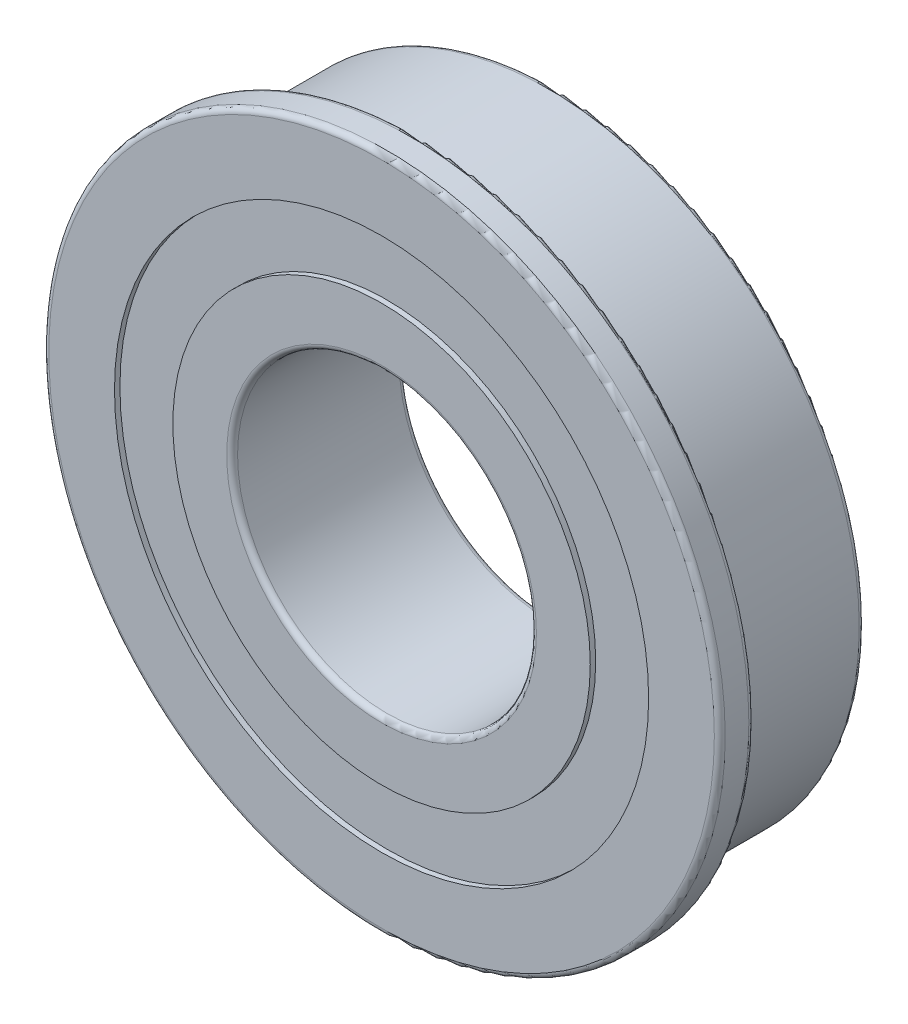
ISO-10303-21;
HEADER;
FILE_DESCRIPTION(('STEP AP214'),'2;1');
FILE_NAME('part.step','',(''),(''),'','','');
FILE_SCHEMA(('AUTOMOTIVE_DESIGN { 1 0 10303 214 1 1 1 1 }'));
ENDSEC;
DATA;
#1=APPLICATION_CONTEXT('core data for automotive mechanical design processes');
#2=APPLICATION_PROTOCOL_DEFINITION('international standard','automotive_design',2000,#1);
#3=PRODUCT_CONTEXT('',#1,'mechanical');
#4=PRODUCT('Part','Part','',(#3));
#5=PRODUCT_RELATED_PRODUCT_CATEGORY('part','',(#4));
#6=PRODUCT_DEFINITION_FORMATION('','',#4);
#7=PRODUCT_DEFINITION_CONTEXT('part definition',#1,'design');
#8=PRODUCT_DEFINITION('design','',#6,#7);
#9=PRODUCT_DEFINITION_SHAPE('','',#8);
#10=(LENGTH_UNIT() NAMED_UNIT(*) SI_UNIT(.MILLI.,.METRE.));
#11=(NAMED_UNIT(*) PLANE_ANGLE_UNIT() SI_UNIT($,.RADIAN.));
#12=(NAMED_UNIT(*) SI_UNIT($,.STERADIAN.) SOLID_ANGLE_UNIT());
#13=UNCERTAINTY_MEASURE_WITH_UNIT(LENGTH_MEASURE(1.E-05),#10,'distance_accuracy_value','');
#14=(GEOMETRIC_REPRESENTATION_CONTEXT(3) GLOBAL_UNCERTAINTY_ASSIGNED_CONTEXT((#13)) GLOBAL_UNIT_ASSIGNED_CONTEXT((#10,
#11,#12)) REPRESENTATION_CONTEXT('',''));
#15=CARTESIAN_POINT('',(0.,0.,0.));
#16=DIRECTION('',(0.,0.,1.));
#17=DIRECTION('',(1.,0.,0.));
#18=AXIS2_PLACEMENT_3D('',#15,#16,#17);
#19=CARTESIAN_POINT('',(0.,0.,-3.71875));
#20=DIRECTION('',(0.,0.,1.));
#21=DIRECTION('',(1.,0.,0.));
#22=AXIS2_PLACEMENT_3D('',#19,#20,#21);
#23=TOROIDAL_SURFACE('',#22,14.0375,0.25);
#24=CARTESIAN_POINT('',(0.,0.,-3.96875));
#25=DIRECTION('',(0.,0.,1.));
#26=DIRECTION('',(1.,0.,0.));
#27=AXIS2_PLACEMENT_3D('',#24,#25,#26);
#28=CIRCLE('',#27,14.0375);
#29=CARTESIAN_POINT('',(14.0375,0.,-3.96875));
#30=VERTEX_POINT('',#29);
#31=EDGE_CURVE('E10',#30,#30,#28,.T.);
#32=ORIENTED_EDGE('',*,*,#31,.T.);
#33=EDGE_LOOP('',(#32));
#34=FACE_BOUND('',#33,.T.);
#35=CARTESIAN_POINT('',(0.,0.,-3.71875));
#36=DIRECTION('',(0.,0.,1.));
#37=DIRECTION('',(1.,0.,0.));
#38=AXIS2_PLACEMENT_3D('',#35,#36,#37);
#39=CIRCLE('',#38,14.2875);
#40=CARTESIAN_POINT('',(14.2875,0.,-3.71875));
#41=VERTEX_POINT('',#40);
#42=EDGE_CURVE('E97',#41,#41,#39,.T.);
#43=ORIENTED_EDGE('',*,*,#42,.F.);
#44=EDGE_LOOP('',(#43));
#45=FACE_BOUND('',#44,.T.);
#46=ADVANCED_FACE('F30',(#34,#45),#23,.T.);
#47=CARTESIAN_POINT('',(14.0375,0.,-3.96875));
#48=DIRECTION('',(0.,0.,-1.));
#49=DIRECTION('',(-1.,0.,0.));
#50=AXIS2_PLACEMENT_3D('',#47,#48,#49);
#51=PLANE('',#50);
#52=CARTESIAN_POINT('',(0.,0.,-3.96875));
#53=DIRECTION('',(0.,0.,1.));
#54=DIRECTION('',(1.,0.,0.));
#55=AXIS2_PLACEMENT_3D('',#52,#53,#54);
#56=CIRCLE('',#55,12.2875);
#57=CARTESIAN_POINT('',(12.2875,0.,-3.96875));
#58=VERTEX_POINT('',#57);
#59=EDGE_CURVE('E36',#58,#58,#56,.T.);
#60=ORIENTED_EDGE('',*,*,#59,.T.);
#61=EDGE_LOOP('',(#60));
#62=FACE_BOUND('',#61,.T.);
#63=ORIENTED_EDGE('',*,*,#31,.F.);
#64=EDGE_LOOP('',(#63));
#65=FACE_BOUND('',#64,.T.);
#66=ADVANCED_FACE('F105',(#62,#65),#51,.T.);
#67=CARTESIAN_POINT('',(0.,0.,-3.9700039936204));
#68=DIRECTION('',(0.,0.,1.));
#69=DIRECTION('',(1.,0.,0.));
#70=AXIS2_PLACEMENT_3D('',#67,#68,#69);
#71=CYLINDRICAL_SURFACE('',#70,12.2875);
#72=CARTESIAN_POINT('',(0.,0.,-3.71875));
#73=DIRECTION('',(0.,0.,1.));
#74=DIRECTION('',(1.,0.,0.));
#75=AXIS2_PLACEMENT_3D('',#72,#73,#74);
#76=CIRCLE('',#75,12.2875);
#77=CARTESIAN_POINT('',(12.2875,0.,-3.71875));
#78=VERTEX_POINT('',#77);
#79=EDGE_CURVE('E40',#78,#78,#76,.T.);
#80=ORIENTED_EDGE('',*,*,#79,.T.);
#81=EDGE_LOOP('',(#80));
#82=FACE_BOUND('',#81,.T.);
#83=ORIENTED_EDGE('',*,*,#59,.F.);
#84=EDGE_LOOP('',(#83));
#85=FACE_BOUND('',#84,.T.);
#86=ADVANCED_FACE('F109',(#82,#85),#71,.F.);
#87=CARTESIAN_POINT('',(12.2875,0.,-3.71875));
#88=DIRECTION('',(0.,0.,-1.));
#89=DIRECTION('',(-1.,0.,0.));
#90=AXIS2_PLACEMENT_3D('',#87,#88,#89);
#91=PLANE('',#90);
#92=CARTESIAN_POINT('',(0.,0.,-3.71875));
#93=DIRECTION('',(0.,0.,1.));
#94=DIRECTION('',(1.,0.,0.));
#95=AXIS2_PLACEMENT_3D('',#92,#93,#94);
#96=CIRCLE('',#95,9.602);
#97=CARTESIAN_POINT('',(9.602,0.,-3.71875));
#98=VERTEX_POINT('',#97);
#99=EDGE_CURVE('E44',#98,#98,#96,.T.);
#100=ORIENTED_EDGE('',*,*,#99,.T.);
#101=EDGE_LOOP('',(#100));
#102=FACE_BOUND('',#101,.T.);
#103=ORIENTED_EDGE('',*,*,#79,.F.);
#104=EDGE_LOOP('',(#103));
#105=FACE_BOUND('',#104,.T.);
#106=ADVANCED_FACE('F113',(#102,#105),#91,.T.);
#107=CARTESIAN_POINT('',(0.,0.,-3.9700039936204));
#108=DIRECTION('',(0.,0.,1.));
#109=DIRECTION('',(1.,0.,0.));
#110=AXIS2_PLACEMENT_3D('',#107,#108,#109);
#111=CYLINDRICAL_SURFACE('',#110,9.602);
#112=CARTESIAN_POINT('',(0.,0.,-3.96875));
#113=DIRECTION('',(0.,0.,1.));
#114=DIRECTION('',(1.,0.,0.));
#115=AXIS2_PLACEMENT_3D('',#112,#113,#114);
#116=CIRCLE('',#115,9.602);
#117=CARTESIAN_POINT('',(9.602,0.,-3.96875));
#118=VERTEX_POINT('',#117);
#119=EDGE_CURVE('E49',#118,#118,#116,.T.);
#120=ORIENTED_EDGE('',*,*,#119,.T.);
#121=EDGE_LOOP('',(#120));
#122=FACE_BOUND('',#121,.T.);
#123=ORIENTED_EDGE('',*,*,#99,.F.);
#124=EDGE_LOOP('',(#123));
#125=FACE_BOUND('',#124,.T.);
#126=ADVANCED_FACE('F120',(#122,#125),#111,.T.);
#127=CARTESIAN_POINT('',(9.602,0.,-3.96875));
#128=DIRECTION('',(0.,0.,-1.));
#129=DIRECTION('',(-1.,0.,0.));
#130=AXIS2_PLACEMENT_3D('',#127,#128,#129);
#131=PLANE('',#130);
#132=CARTESIAN_POINT('',(0.,0.,-3.96875));
#133=DIRECTION('',(0.,0.,1.));
#134=DIRECTION('',(1.,0.,0.));
#135=AXIS2_PLACEMENT_3D('',#132,#133,#134);
#136=CIRCLE('',#135,7.125);
#137=CARTESIAN_POINT('',(7.125,0.,-3.96875));
#138=VERTEX_POINT('',#137);
#139=EDGE_CURVE('E52',#138,#138,#136,.T.);
#140=ORIENTED_EDGE('',*,*,#139,.T.);
#141=EDGE_LOOP('',(#140));
#142=FACE_BOUND('',#141,.T.);
#143=ORIENTED_EDGE('',*,*,#119,.F.);
#144=EDGE_LOOP('',(#143));
#145=FACE_BOUND('',#144,.T.);
#146=ADVANCED_FACE('F124',(#142,#145),#131,.T.);
#147=CARTESIAN_POINT('',(0.,0.,-3.71875));
#148=DIRECTION('',(0.,0.,1.));
#149=DIRECTION('',(1.,0.,0.));
#150=AXIS2_PLACEMENT_3D('',#147,#148,#149);
#151=TOROIDAL_SURFACE('',#150,7.125,0.25);
#152=CARTESIAN_POINT('',(0.,0.,-3.71875));
#153=DIRECTION('',(0.,0.,1.));
#154=DIRECTION('',(1.,0.,0.));
#155=AXIS2_PLACEMENT_3D('',#152,#153,#154);
#156=CIRCLE('',#155,6.875);
#157=CARTESIAN_POINT('',(6.875,0.,-3.71875));
#158=VERTEX_POINT('',#157);
#159=EDGE_CURVE('E55',#158,#158,#156,.T.);
#160=ORIENTED_EDGE('',*,*,#159,.T.);
#161=EDGE_LOOP('',(#160));
#162=FACE_BOUND('',#161,.T.);
#163=ORIENTED_EDGE('',*,*,#139,.F.);
#164=EDGE_LOOP('',(#163));
#165=FACE_BOUND('',#164,.T.);
#166=ADVANCED_FACE('F128',(#162,#165),#151,.T.);
#167=CARTESIAN_POINT('',(0.,0.,-3.9700039936204));
#168=DIRECTION('',(0.,0.,1.));
#169=DIRECTION('',(1.,0.,0.));
#170=AXIS2_PLACEMENT_3D('',#167,#168,#169);
#171=CYLINDRICAL_SURFACE('',#170,6.875);
#172=CARTESIAN_POINT('',(0.,0.,3.71875));
#173=DIRECTION('',(0.,0.,1.));
#174=DIRECTION('',(1.,0.,0.));
#175=AXIS2_PLACEMENT_3D('',#172,#173,#174);
#176=CIRCLE('',#175,6.875);
#177=CARTESIAN_POINT('',(6.875,0.,3.71875));
#178=VERTEX_POINT('',#177);
#179=EDGE_CURVE('E58',#178,#178,#176,.T.);
#180=ORIENTED_EDGE('',*,*,#179,.T.);
#181=EDGE_LOOP('',(#180));
#182=FACE_BOUND('',#181,.T.);
#183=ORIENTED_EDGE('',*,*,#159,.F.);
#184=EDGE_LOOP('',(#183));
#185=FACE_BOUND('',#184,.T.);
#186=ADVANCED_FACE('F132',(#182,#185),#171,.F.);
#187=CARTESIAN_POINT('',(0.,0.,3.71875));
#188=DIRECTION('',(0.,0.,1.));
#189=DIRECTION('',(1.,0.,0.));
#190=AXIS2_PLACEMENT_3D('',#187,#188,#189);
#191=TOROIDAL_SURFACE('',#190,7.125,0.25);
#192=CARTESIAN_POINT('',(0.,0.,3.96875));
#193=DIRECTION('',(0.,0.,1.));
#194=DIRECTION('',(1.,0.,0.));
#195=AXIS2_PLACEMENT_3D('',#192,#193,#194);
#196=CIRCLE('',#195,7.125);
#197=CARTESIAN_POINT('',(7.125,0.,3.96875));
#198=VERTEX_POINT('',#197);
#199=EDGE_CURVE('E61',#198,#198,#196,.T.);
#200=ORIENTED_EDGE('',*,*,#199,.T.);
#201=EDGE_LOOP('',(#200));
#202=FACE_BOUND('',#201,.T.);
#203=ORIENTED_EDGE('',*,*,#179,.F.);
#204=EDGE_LOOP('',(#203));
#205=FACE_BOUND('',#204,.T.);
#206=ADVANCED_FACE('F136',(#202,#205),#191,.T.);
#207=CARTESIAN_POINT('',(7.125,0.,3.96875));
#208=DIRECTION('',(0.,0.,1.));
#209=DIRECTION('',(1.,0.,0.));
#210=AXIS2_PLACEMENT_3D('',#207,#208,#209);
#211=PLANE('',#210);
#212=CARTESIAN_POINT('',(0.,0.,3.96875));
#213=DIRECTION('',(0.,0.,1.));
#214=DIRECTION('',(1.,0.,0.));
#215=AXIS2_PLACEMENT_3D('',#212,#213,#214);
#216=CIRCLE('',#215,9.602);
#217=CARTESIAN_POINT('',(9.602,0.,3.96875));
#218=VERTEX_POINT('',#217);
#219=EDGE_CURVE('E64',#218,#218,#216,.T.);
#220=ORIENTED_EDGE('',*,*,#219,.T.);
#221=EDGE_LOOP('',(#220));
#222=FACE_BOUND('',#221,.T.);
#223=ORIENTED_EDGE('',*,*,#199,.F.);
#224=EDGE_LOOP('',(#223));
#225=FACE_BOUND('',#224,.T.);
#226=ADVANCED_FACE('F140',(#222,#225),#211,.T.);
#227=CARTESIAN_POINT('',(0.,0.,-3.9700039936204));
#228=DIRECTION('',(0.,0.,1.));
#229=DIRECTION('',(1.,0.,0.));
#230=AXIS2_PLACEMENT_3D('',#227,#228,#229);
#231=CYLINDRICAL_SURFACE('',#230,9.602);
#232=CARTESIAN_POINT('',(0.,0.,3.71875));
#233=DIRECTION('',(0.,0.,1.));
#234=DIRECTION('',(1.,0.,0.));
#235=AXIS2_PLACEMENT_3D('',#232,#233,#234);
#236=CIRCLE('',#235,9.602);
#237=CARTESIAN_POINT('',(9.602,0.,3.71875));
#238=VERTEX_POINT('',#237);
#239=EDGE_CURVE('E67',#238,#238,#236,.T.);
#240=ORIENTED_EDGE('',*,*,#239,.T.);
#241=EDGE_LOOP('',(#240));
#242=FACE_BOUND('',#241,.T.);
#243=ORIENTED_EDGE('',*,*,#219,.F.);
#244=EDGE_LOOP('',(#243));
#245=FACE_BOUND('',#244,.T.);
#246=ADVANCED_FACE('F144',(#242,#245),#231,.T.);
#247=CARTESIAN_POINT('',(9.602,0.,3.71875));
#248=DIRECTION('',(0.,0.,1.));
#249=DIRECTION('',(1.,0.,0.));
#250=AXIS2_PLACEMENT_3D('',#247,#248,#249);
#251=PLANE('',#250);
#252=CARTESIAN_POINT('',(0.,0.,3.71875));
#253=DIRECTION('',(0.,0.,1.));
#254=DIRECTION('',(1.,0.,0.));
#255=AXIS2_PLACEMENT_3D('',#252,#253,#254);
#256=CIRCLE('',#255,12.2875);
#257=CARTESIAN_POINT('',(12.2875,0.,3.71875));
#258=VERTEX_POINT('',#257);
#259=EDGE_CURVE('E70',#258,#258,#256,.T.);
#260=ORIENTED_EDGE('',*,*,#259,.T.);
#261=EDGE_LOOP('',(#260));
#262=FACE_BOUND('',#261,.T.);
#263=ORIENTED_EDGE('',*,*,#239,.F.);
#264=EDGE_LOOP('',(#263));
#265=FACE_BOUND('',#264,.T.);
#266=ADVANCED_FACE('F148',(#262,#265),#251,.T.);
#267=CARTESIAN_POINT('',(0.,0.,-3.9700039936204));
#268=DIRECTION('',(0.,0.,1.));
#269=DIRECTION('',(1.,0.,0.));
#270=AXIS2_PLACEMENT_3D('',#267,#268,#269);
#271=CYLINDRICAL_SURFACE('',#270,12.2875);
#272=CARTESIAN_POINT('',(0.,0.,3.96875));
#273=DIRECTION('',(0.,0.,1.));
#274=DIRECTION('',(1.,0.,0.));
#275=AXIS2_PLACEMENT_3D('',#272,#273,#274);
#276=CIRCLE('',#275,12.2875);
#277=CARTESIAN_POINT('',(12.2875,0.,3.96875));
#278=VERTEX_POINT('',#277);
#279=EDGE_CURVE('E73',#278,#278,#276,.T.);
#280=ORIENTED_EDGE('',*,*,#279,.T.);
#281=EDGE_LOOP('',(#280));
#282=FACE_BOUND('',#281,.T.);
#283=ORIENTED_EDGE('',*,*,#259,.F.);
#284=EDGE_LOOP('',(#283));
#285=FACE_BOUND('',#284,.T.);
#286=ADVANCED_FACE('F152',(#282,#285),#271,.F.);
#287=CARTESIAN_POINT('',(12.2875,0.,3.96875));
#288=DIRECTION('',(0.,0.,1.));
#289=DIRECTION('',(1.,0.,0.));
#290=AXIS2_PLACEMENT_3D('',#287,#288,#289);
#291=PLANE('',#290);
#292=CARTESIAN_POINT('',(0.,0.,3.96875));
#293=DIRECTION('',(0.,0.,1.));
#294=DIRECTION('',(1.,0.,0.));
#295=AXIS2_PLACEMENT_3D('',#292,#293,#294);
#296=CIRCLE('',#295,15.31);
#297=CARTESIAN_POINT('',(15.31,0.,3.96875));
#298=VERTEX_POINT('',#297);
#299=EDGE_CURVE('E76',#298,#298,#296,.T.);
#300=ORIENTED_EDGE('',*,*,#299,.T.);
#301=EDGE_LOOP('',(#300));
#302=FACE_BOUND('',#301,.T.);
#303=ORIENTED_EDGE('',*,*,#279,.F.);
#304=EDGE_LOOP('',(#303));
#305=FACE_BOUND('',#304,.T.);
#306=ADVANCED_FACE('F156',(#302,#305),#291,.T.);
#307=CARTESIAN_POINT('',(0.,0.,3.71875));
#308=DIRECTION('',(0.,0.,1.));
#309=DIRECTION('',(1.,0.,0.));
#310=AXIS2_PLACEMENT_3D('',#307,#308,#309);
#311=TOROIDAL_SURFACE('',#310,15.31,0.25);
#312=CARTESIAN_POINT('',(0.,0.,3.71875));
#313=DIRECTION('',(0.,0.,1.));
#314=DIRECTION('',(1.,0.,0.));
#315=AXIS2_PLACEMENT_3D('',#312,#313,#314);
#316=CIRCLE('',#315,15.56);
#317=CARTESIAN_POINT('',(15.56,0.,3.71875));
#318=VERTEX_POINT('',#317);
#319=EDGE_CURVE('E79',#318,#318,#316,.T.);
#320=ORIENTED_EDGE('',*,*,#319,.T.);
#321=EDGE_LOOP('',(#320));
#322=FACE_BOUND('',#321,.T.);
#323=ORIENTED_EDGE('',*,*,#299,.F.);
#324=EDGE_LOOP('',(#323));
#325=FACE_BOUND('',#324,.T.);
#326=ADVANCED_FACE('F160',(#322,#325),#311,.T.);
#327=CARTESIAN_POINT('',(0.,0.,-3.9700039936204));
#328=DIRECTION('',(0.,0.,1.));
#329=DIRECTION('',(1.,0.,0.));
#330=AXIS2_PLACEMENT_3D('',#327,#328,#329);
#331=CYLINDRICAL_SURFACE('',#330,15.56);
#332=CARTESIAN_POINT('',(0.,0.,2.63125));
#333=DIRECTION('',(0.,0.,1.));
#334=DIRECTION('',(1.,0.,0.));
#335=AXIS2_PLACEMENT_3D('',#332,#333,#334);
#336=CIRCLE('',#335,15.56);
#337=CARTESIAN_POINT('',(15.56,0.,2.63125));
#338=VERTEX_POINT('',#337);
#339=EDGE_CURVE('E82',#338,#338,#336,.T.);
#340=ORIENTED_EDGE('',*,*,#339,.T.);
#341=EDGE_LOOP('',(#340));
#342=FACE_BOUND('',#341,.T.);
#343=ORIENTED_EDGE('',*,*,#319,.F.);
#344=EDGE_LOOP('',(#343));
#345=FACE_BOUND('',#344,.T.);
#346=ADVANCED_FACE('F164',(#342,#345),#331,.T.);
#347=CARTESIAN_POINT('',(0.,0.,2.63125));
#348=DIRECTION('',(0.,0.,1.));
#349=DIRECTION('',(1.,0.,0.));
#350=AXIS2_PLACEMENT_3D('',#347,#348,#349);
#351=TOROIDAL_SURFACE('',#350,15.31,0.25);
#352=CARTESIAN_POINT('',(0.,0.,2.38125));
#353=DIRECTION('',(0.,0.,1.));
#354=DIRECTION('',(1.,0.,0.));
#355=AXIS2_PLACEMENT_3D('',#352,#353,#354);
#356=CIRCLE('',#355,15.31);
#357=CARTESIAN_POINT('',(15.31,0.,2.38125));
#358=VERTEX_POINT('',#357);
#359=EDGE_CURVE('E85',#358,#358,#356,.T.);
#360=ORIENTED_EDGE('',*,*,#359,.T.);
#361=EDGE_LOOP('',(#360));
#362=FACE_BOUND('',#361,.T.);
#363=ORIENTED_EDGE('',*,*,#339,.F.);
#364=EDGE_LOOP('',(#363));
#365=FACE_BOUND('',#364,.T.);
#366=ADVANCED_FACE('F168',(#362,#365),#351,.T.);
#367=CARTESIAN_POINT('',(15.31,0.,2.38125));
#368=DIRECTION('',(0.,0.,-1.));
#369=DIRECTION('',(-1.,0.,0.));
#370=AXIS2_PLACEMENT_3D('',#367,#368,#369);
#371=PLANE('',#370);
#372=CARTESIAN_POINT('',(0.,0.,2.38125));
#373=DIRECTION('',(0.,0.,1.));
#374=DIRECTION('',(1.,0.,0.));
#375=AXIS2_PLACEMENT_3D('',#372,#373,#374);
#376=CIRCLE('',#375,14.2875);
#377=CARTESIAN_POINT('',(14.2875,0.,2.38125));
#378=VERTEX_POINT('',#377);
#379=EDGE_CURVE('E88',#378,#378,#376,.T.);
#380=ORIENTED_EDGE('',*,*,#379,.T.);
#381=EDGE_LOOP('',(#380));
#382=FACE_BOUND('',#381,.T.);
#383=ORIENTED_EDGE('',*,*,#359,.F.);
#384=EDGE_LOOP('',(#383));
#385=FACE_BOUND('',#384,.T.);
#386=ADVANCED_FACE('F172',(#382,#385),#371,.T.);
#387=CARTESIAN_POINT('',(0.,0.,2.13125));
#388=DIRECTION('',(0.,0.,1.));
#389=DIRECTION('',(1.,0.,0.));
#390=AXIS2_PLACEMENT_3D('',#387,#388,#389);
#391=TOROIDAL_SURFACE('',#390,14.2875,0.249999999999999);
#392=CARTESIAN_POINT('',(0.,0.,2.00625));
#393=DIRECTION('',(0.,0.,1.));
#394=DIRECTION('',(1.,0.,0.));
#395=AXIS2_PLACEMENT_3D('',#392,#393,#394);
#396=CIRCLE('',#395,14.0709936490539);
#397=CARTESIAN_POINT('',(14.0709936490539,0.,2.00625));
#398=VERTEX_POINT('',#397);
#399=EDGE_CURVE('E91',#398,#398,#396,.T.);
#400=ORIENTED_EDGE('',*,*,#399,.T.);
#401=EDGE_LOOP('',(#400));
#402=FACE_BOUND('',#401,.T.);
#403=ORIENTED_EDGE('',*,*,#379,.F.);
#404=EDGE_LOOP('',(#403));
#405=FACE_BOUND('',#404,.T.);
#406=ADVANCED_FACE('F176',(#402,#405),#391,.F.);
#407=CARTESIAN_POINT('',(0.,0.,2.00625));
#408=DIRECTION('',(0.,0.,-1.));
#409=DIRECTION('',(-1.,0.,0.));
#410=AXIS2_PLACEMENT_3D('',#407,#408,#409);
#411=CONICAL_SURFACE('',#410,14.0709936490539,0.523598775598294);
#412=CARTESIAN_POINT('',(0.,0.,1.63125));
#413=DIRECTION('',(0.,0.,1.));
#414=DIRECTION('',(1.,0.,0.));
#415=AXIS2_PLACEMENT_3D('',#412,#413,#414);
#416=CIRCLE('',#415,14.2875);
#417=CARTESIAN_POINT('',(14.2875,0.,1.63125));
#418=VERTEX_POINT('',#417);
#419=EDGE_CURVE('E94',#418,#418,#416,.T.);
#420=ORIENTED_EDGE('',*,*,#419,.T.);
#421=EDGE_LOOP('',(#420));
#422=FACE_BOUND('',#421,.T.);
#423=ORIENTED_EDGE('',*,*,#399,.F.);
#424=EDGE_LOOP('',(#423));
#425=FACE_BOUND('',#424,.T.);
#426=ADVANCED_FACE('F180',(#422,#425),#411,.T.);
#427=CARTESIAN_POINT('',(0.,0.,-3.9700039936204));
#428=DIRECTION('',(0.,0.,1.));
#429=DIRECTION('',(1.,0.,0.));
#430=AXIS2_PLACEMENT_3D('',#427,#428,#429);
#431=CYLINDRICAL_SURFACE('',#430,14.2875);
#432=ORIENTED_EDGE('',*,*,#42,.T.);
#433=EDGE_LOOP('',(#432));
#434=FACE_BOUND('',#433,.T.);
#435=ORIENTED_EDGE('',*,*,#419,.F.);
#436=EDGE_LOOP('',(#435));
#437=FACE_BOUND('',#436,.T.);
#438=ADVANCED_FACE('F101',(#434,#437),#431,.T.);
#439=CLOSED_SHELL('',(#46,#66,#86,#106,#126,#146,#166,#186,#206,#226,#246,#266,#286,#306,#326,
#346,#366,#386,#406,#426,#438));
#440=MANIFOLD_SOLID_BREP('B2',#439);
#441=ADVANCED_BREP_SHAPE_REPRESENTATION('',(#18,#440),#14);
#442=SHAPE_DEFINITION_REPRESENTATION(#9,#441);
ENDSEC;
END-ISO-10303-21;
